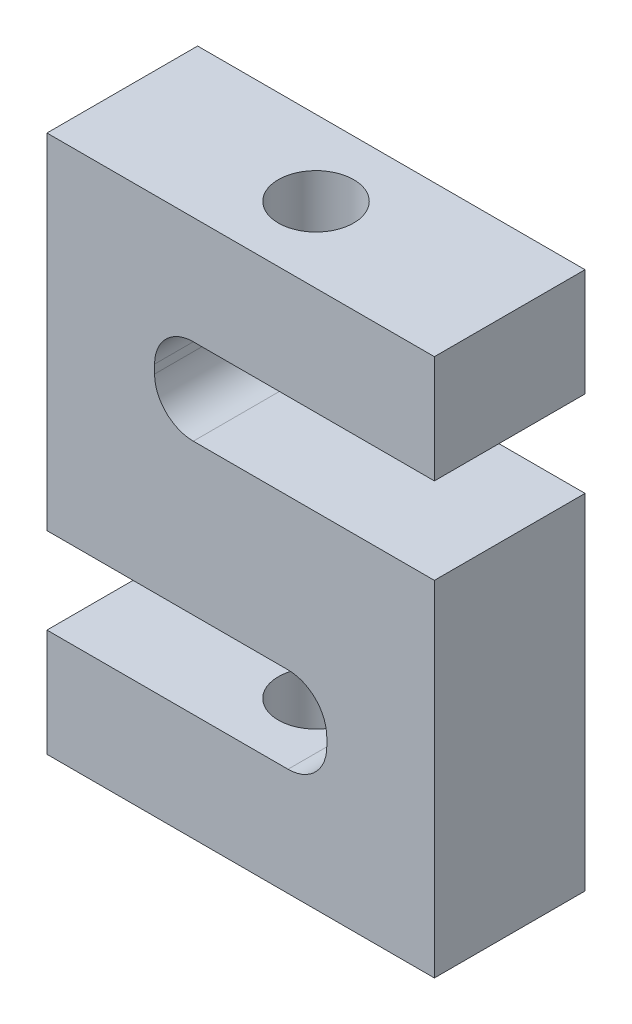
ISO-10303-21;
HEADER;
FILE_DESCRIPTION(('STEP AP214'),'2;1');
FILE_NAME('part.step','',(''),(''),'','','');
FILE_SCHEMA(('AUTOMOTIVE_DESIGN { 1 0 10303 214 1 1 1 1 }'));
ENDSEC;
DATA;
#1=APPLICATION_CONTEXT('core data for automotive mechanical design processes');
#2=APPLICATION_PROTOCOL_DEFINITION('international standard','automotive_design',2000,#1);
#3=PRODUCT_CONTEXT('',#1,'mechanical');
#4=PRODUCT('Part','Part','',(#3));
#5=PRODUCT_RELATED_PRODUCT_CATEGORY('part','',(#4));
#6=PRODUCT_DEFINITION_FORMATION('','',#4);
#7=PRODUCT_DEFINITION_CONTEXT('part definition',#1,'design');
#8=PRODUCT_DEFINITION('design','',#6,#7);
#9=PRODUCT_DEFINITION_SHAPE('','',#8);
#10=(LENGTH_UNIT() NAMED_UNIT(*) SI_UNIT(.MILLI.,.METRE.));
#11=(NAMED_UNIT(*) PLANE_ANGLE_UNIT() SI_UNIT($,.RADIAN.));
#12=(NAMED_UNIT(*) SI_UNIT($,.STERADIAN.) SOLID_ANGLE_UNIT());
#13=UNCERTAINTY_MEASURE_WITH_UNIT(LENGTH_MEASURE(1.E-05),#10,'distance_accuracy_value','');
#14=(GEOMETRIC_REPRESENTATION_CONTEXT(3) GLOBAL_UNCERTAINTY_ASSIGNED_CONTEXT((#13)) GLOBAL_UNIT_ASSIGNED_CONTEXT((#10,
#11,#12)) REPRESENTATION_CONTEXT('',''));
#15=CARTESIAN_POINT('',(0.,0.,0.));
#16=DIRECTION('',(0.,0.,1.));
#17=DIRECTION('',(1.,0.,0.));
#18=AXIS2_PLACEMENT_3D('',#15,#16,#17);
#19=CARTESIAN_POINT('',(-31.75,57.15,44.45));
#20=DIRECTION('',(0.,-1.,0.));
#21=DIRECTION('',(0.,0.,-1.));
#22=AXIS2_PLACEMENT_3D('',#19,#20,#21);
#23=PLANE('',#22);
#24=DIRECTION('',(-1.,0.,0.));
#25=VECTOR('',#24,1.);
#26=CARTESIAN_POINT('',(-31.75,57.15,0.));
#27=LINE('',#26,#25);
#28=CARTESIAN_POINT('',(82.55,57.15,0.));
#29=VERTEX_POINT('',#28);
#30=CARTESIAN_POINT('',(-31.75,57.15,0.));
#31=VERTEX_POINT('',#30);
#32=EDGE_CURVE('E321',#29,#31,#27,.T.);
#33=ORIENTED_EDGE('',*,*,#32,.T.);
#34=DIRECTION('',(0.,0.,-1.));
#35=VECTOR('',#34,1.);
#36=CARTESIAN_POINT('',(-31.75,57.15,44.45));
#37=LINE('',#36,#35);
#38=CARTESIAN_POINT('',(-31.75,57.15,44.45));
#39=VERTEX_POINT('',#38);
#40=EDGE_CURVE('E356',#39,#31,#37,.T.);
#41=ORIENTED_EDGE('',*,*,#40,.F.);
#42=DIRECTION('',(-1.,0.,0.));
#43=VECTOR('',#42,1.);
#44=CARTESIAN_POINT('',(-31.75,57.15,44.45));
#45=LINE('',#44,#43);
#46=CARTESIAN_POINT('',(82.55,57.15,44.45));
#47=VERTEX_POINT('',#46);
#48=EDGE_CURVE('E275',#47,#39,#45,.T.);
#49=ORIENTED_EDGE('',*,*,#48,.F.);
#50=DIRECTION('',(0.,0.,-1.));
#51=VECTOR('',#50,1.);
#52=CARTESIAN_POINT('',(82.55,57.15,44.45));
#53=LINE('',#52,#51);
#54=EDGE_CURVE('E218',#47,#29,#53,.T.);
#55=ORIENTED_EDGE('',*,*,#54,.T.);
#56=EDGE_LOOP('',(#33,#41,#49,#55));
#57=FACE_BOUND('',#56,.T.);
#58=CARTESIAN_POINT('',(25.3999999999999,57.15,22.225));
#59=DIRECTION('',(0.,1.,0.));
#60=DIRECTION('',(0.,0.,1.));
#61=AXIS2_PLACEMENT_3D('',#58,#59,#60);
#62=CIRCLE('',#61,11.1125);
#63=CARTESIAN_POINT('',(25.3999999999999,57.15,33.3375));
#64=VERTEX_POINT('',#63);
#65=EDGE_CURVE('E266',#64,#64,#62,.T.);
#66=ORIENTED_EDGE('',*,*,#65,.F.);
#67=EDGE_LOOP('',(#66));
#68=FACE_BOUND('',#67,.T.);
#69=ADVANCED_FACE('F43',(#57,#68),#23,.F.);
#70=CARTESIAN_POINT('',(82.55,-101.6,44.45));
#71=DIRECTION('',(0.,1.,0.));
#72=DIRECTION('',(0.,0.,1.));
#73=AXIS2_PLACEMENT_3D('',#70,#71,#72);
#74=PLANE('',#73);
#75=DIRECTION('',(1.,0.,0.));
#76=VECTOR('',#75,1.);
#77=CARTESIAN_POINT('',(82.55,-101.6,0.));
#78=LINE('',#77,#76);
#79=CARTESIAN_POINT('',(-31.75,-101.6,0.));
#80=VERTEX_POINT('',#79);
#81=CARTESIAN_POINT('',(82.55,-101.6,0.));
#82=VERTEX_POINT('',#81);
#83=EDGE_CURVE('E202',#80,#82,#78,.T.);
#84=ORIENTED_EDGE('',*,*,#83,.T.);
#85=DIRECTION('',(0.,0.,-1.));
#86=VECTOR('',#85,1.);
#87=CARTESIAN_POINT('',(82.55,-101.6,44.45));
#88=LINE('',#87,#86);
#89=CARTESIAN_POINT('',(82.55,-101.6,44.45));
#90=VERTEX_POINT('',#89);
#91=EDGE_CURVE('E307',#90,#82,#88,.T.);
#92=ORIENTED_EDGE('',*,*,#91,.F.);
#93=DIRECTION('',(1.,0.,0.));
#94=VECTOR('',#93,1.);
#95=CARTESIAN_POINT('',(82.55,-101.6,44.45));
#96=LINE('',#95,#94);
#97=CARTESIAN_POINT('',(-31.75,-101.6,44.45));
#98=VERTEX_POINT('',#97);
#99=EDGE_CURVE('E197',#98,#90,#96,.T.);
#100=ORIENTED_EDGE('',*,*,#99,.F.);
#101=DIRECTION('',(0.,0.,-1.));
#102=VECTOR('',#101,1.);
#103=CARTESIAN_POINT('',(-31.75,-101.6,44.45));
#104=LINE('',#103,#102);
#105=EDGE_CURVE('E344',#98,#80,#104,.T.);
#106=ORIENTED_EDGE('',*,*,#105,.T.);
#107=EDGE_LOOP('',(#84,#92,#100,#106));
#108=FACE_BOUND('',#107,.T.);
#109=CARTESIAN_POINT('',(25.4,-101.6,22.225));
#110=DIRECTION('',(0.,-1.,0.));
#111=DIRECTION('',(0.,0.,-1.));
#112=AXIS2_PLACEMENT_3D('',#109,#110,#111);
#113=CIRCLE('',#112,11.1125);
#114=CARTESIAN_POINT('',(25.4,-101.6,11.1125));
#115=VERTEX_POINT('',#114);
#116=EDGE_CURVE('E272',#115,#115,#113,.T.);
#117=ORIENTED_EDGE('',*,*,#116,.F.);
#118=EDGE_LOOP('',(#117));
#119=FACE_BOUND('',#118,.T.);
#120=ADVANCED_FACE('F407',(#108,#119),#74,.F.);
#121=CARTESIAN_POINT('',(82.55,0.,44.45));
#122=DIRECTION('',(-1.,0.,0.));
#123=DIRECTION('',(0.,0.,1.));
#124=AXIS2_PLACEMENT_3D('',#121,#122,#123);
#125=PLANE('',#124);
#126=DIRECTION('',(0.,1.,0.));
#127=VECTOR('',#126,1.);
#128=CARTESIAN_POINT('',(82.55,0.,0.));
#129=LINE('',#128,#127);
#130=CARTESIAN_POINT('',(82.55,0.,0.));
#131=VERTEX_POINT('',#130);
#132=EDGE_CURVE('E206',#82,#131,#129,.T.);
#133=ORIENTED_EDGE('',*,*,#132,.T.);
#134=DIRECTION('',(0.,0.,-1.));
#135=VECTOR('',#134,1.);
#136=CARTESIAN_POINT('',(82.55,0.,44.45));
#137=LINE('',#136,#135);
#138=CARTESIAN_POINT('',(82.55,0.,44.45));
#139=VERTEX_POINT('',#138);
#140=EDGE_CURVE('E186',#139,#131,#137,.T.);
#141=ORIENTED_EDGE('',*,*,#140,.F.);
#142=DIRECTION('',(0.,1.,0.));
#143=VECTOR('',#142,1.);
#144=CARTESIAN_POINT('',(82.55,0.,44.45));
#145=LINE('',#144,#143);
#146=EDGE_CURVE('E192',#90,#139,#145,.T.);
#147=ORIENTED_EDGE('',*,*,#146,.F.);
#148=ORIENTED_EDGE('',*,*,#91,.T.);
#149=EDGE_LOOP('',(#133,#141,#147,#148));
#150=FACE_BOUND('',#149,.T.);
#151=ADVANCED_FACE('F204',(#150),#125,.F.);
#152=CARTESIAN_POINT('',(82.55,0.,44.45));
#153=DIRECTION('',(0.,-1.,0.));
#154=DIRECTION('',(1.,0.,0.));
#155=AXIS2_PLACEMENT_3D('',#152,#153,#154);
#156=PLANE('',#155);
#157=DIRECTION('',(-1.,0.,0.));
#158=VECTOR('',#157,1.);
#159=CARTESIAN_POINT('',(82.55,0.,0.));
#160=LINE('',#159,#158);
#161=CARTESIAN_POINT('',(11.43,0.,0.));
#162=VERTEX_POINT('',#161);
#163=EDGE_CURVE('E264',#131,#162,#160,.T.);
#164=ORIENTED_EDGE('',*,*,#163,.T.);
#165=DIRECTION('',(0.,0.,-1.));
#166=VECTOR('',#165,1.);
#167=CARTESIAN_POINT('',(11.43,0.,44.45));
#168=LINE('',#167,#166);
#169=CARTESIAN_POINT('',(11.43,0.,44.45));
#170=VERTEX_POINT('',#169);
#171=EDGE_CURVE('E62',#162,#170,#168,.F.);
#172=ORIENTED_EDGE('',*,*,#171,.T.);
#173=DIRECTION('',(-1.,0.,0.));
#174=VECTOR('',#173,1.);
#175=CARTESIAN_POINT('',(82.55,0.,44.45));
#176=LINE('',#175,#174);
#177=EDGE_CURVE('E182',#139,#170,#176,.T.);
#178=ORIENTED_EDGE('',*,*,#177,.F.);
#179=ORIENTED_EDGE('',*,*,#140,.T.);
#180=EDGE_LOOP('',(#164,#172,#178,#179));
#181=FACE_BOUND('',#180,.T.);
#182=ADVANCED_FACE('F184',(#181),#156,.F.);
#183=CARTESIAN_POINT('',(0.,25.4,44.45));
#184=DIRECTION('',(-1.,0.,0.));
#185=DIRECTION('',(0.,0.,1.));
#186=AXIS2_PLACEMENT_3D('',#183,#184,#185);
#187=PLANE('',#186);
#188=DIRECTION('',(0.,1.,0.));
#189=VECTOR('',#188,1.);
#190=CARTESIAN_POINT('',(0.,25.4,0.));
#191=LINE('',#190,#189);
#192=CARTESIAN_POINT('',(0.,11.43,0.));
#193=VERTEX_POINT('',#192);
#194=CARTESIAN_POINT('',(0.,13.97,0.));
#195=VERTEX_POINT('',#194);
#196=EDGE_CURVE('E312',#193,#195,#191,.T.);
#197=ORIENTED_EDGE('',*,*,#196,.T.);
#198=DIRECTION('',(0.,0.,-1.));
#199=VECTOR('',#198,1.);
#200=CARTESIAN_POINT('',(0.,13.97,44.45));
#201=LINE('',#200,#199);
#202=CARTESIAN_POINT('',(0.,13.97,44.45));
#203=VERTEX_POINT('',#202);
#204=EDGE_CURVE('E239',#195,#203,#201,.F.);
#205=ORIENTED_EDGE('',*,*,#204,.T.);
#206=DIRECTION('',(0.,1.,0.));
#207=VECTOR('',#206,1.);
#208=CARTESIAN_POINT('',(0.,25.4,44.45));
#209=LINE('',#208,#207);
#210=CARTESIAN_POINT('',(0.,11.43,44.45));
#211=VERTEX_POINT('',#210);
#212=EDGE_CURVE('E191',#211,#203,#209,.T.);
#213=ORIENTED_EDGE('',*,*,#212,.F.);
#214=DIRECTION('',(0.,0.,-1.));
#215=VECTOR('',#214,1.);
#216=CARTESIAN_POINT('',(0.,11.43,0.));
#217=LINE('',#216,#215);
#218=EDGE_CURVE('E235',#211,#193,#217,.T.);
#219=ORIENTED_EDGE('',*,*,#218,.T.);
#220=EDGE_LOOP('',(#197,#205,#213,#219));
#221=FACE_BOUND('',#220,.T.);
#222=ADVANCED_FACE('F412',(#221),#187,.F.);
#223=CARTESIAN_POINT('',(82.55,25.4,44.45));
#224=DIRECTION('',(0.,1.,0.));
#225=DIRECTION('',(0.,0.,1.));
#226=AXIS2_PLACEMENT_3D('',#223,#224,#225);
#227=PLANE('',#226);
#228=CARTESIAN_POINT('',(25.3999999999999,25.4,22.225));
#229=DIRECTION('',(0.,1.,0.));
#230=DIRECTION('',(0.,0.,1.));
#231=AXIS2_PLACEMENT_3D('',#228,#229,#230);
#232=CIRCLE('',#231,11.1125);
#233=CARTESIAN_POINT('',(25.3999999999999,25.4,33.3375));
#234=VERTEX_POINT('',#233);
#235=EDGE_CURVE('E269',#234,#234,#232,.T.);
#236=ORIENTED_EDGE('',*,*,#235,.T.);
#237=EDGE_LOOP('',(#236));
#238=FACE_BOUND('',#237,.T.);
#239=DIRECTION('',(1.,0.,0.));
#240=VECTOR('',#239,1.);
#241=CARTESIAN_POINT('',(82.55,25.4,44.45));
#242=LINE('',#241,#240);
#243=CARTESIAN_POINT('',(11.43,25.4,44.45));
#244=VERTEX_POINT('',#243);
#245=CARTESIAN_POINT('',(82.55,25.4,44.45));
#246=VERTEX_POINT('',#245);
#247=EDGE_CURVE('E280',#244,#246,#242,.T.);
#248=ORIENTED_EDGE('',*,*,#247,.F.);
#249=DIRECTION('',(0.,0.,-1.));
#250=VECTOR('',#249,1.);
#251=CARTESIAN_POINT('',(11.43,25.4,0.));
#252=LINE('',#251,#250);
#253=CARTESIAN_POINT('',(11.43,25.4,0.));
#254=VERTEX_POINT('',#253);
#255=EDGE_CURVE('E231',#244,#254,#252,.T.);
#256=ORIENTED_EDGE('',*,*,#255,.T.);
#257=DIRECTION('',(1.,0.,0.));
#258=VECTOR('',#257,1.);
#259=CARTESIAN_POINT('',(82.55,25.4,0.));
#260=LINE('',#259,#258);
#261=CARTESIAN_POINT('',(82.55,25.4,0.));
#262=VERTEX_POINT('',#261);
#263=EDGE_CURVE('E315',#254,#262,#260,.T.);
#264=ORIENTED_EDGE('',*,*,#263,.T.);
#265=DIRECTION('',(0.,0.,-1.));
#266=VECTOR('',#265,1.);
#267=CARTESIAN_POINT('',(82.55,25.4,44.45));
#268=LINE('',#267,#266);
#269=EDGE_CURVE('E209',#246,#262,#268,.T.);
#270=ORIENTED_EDGE('',*,*,#269,.F.);
#271=EDGE_LOOP('',(#248,#256,#264,#270));
#272=FACE_BOUND('',#271,.T.);
#273=ADVANCED_FACE('F420',(#238,#272),#227,.F.);
#274=CARTESIAN_POINT('',(82.55,57.15,44.45));
#275=DIRECTION('',(-1.,0.,0.));
#276=DIRECTION('',(0.,0.,1.));
#277=AXIS2_PLACEMENT_3D('',#274,#275,#276);
#278=PLANE('',#277);
#279=DIRECTION('',(0.,1.,0.));
#280=VECTOR('',#279,1.);
#281=CARTESIAN_POINT('',(82.55,57.15,0.));
#282=LINE('',#281,#280);
#283=EDGE_CURVE('E318',#262,#29,#282,.T.);
#284=ORIENTED_EDGE('',*,*,#283,.T.);
#285=ORIENTED_EDGE('',*,*,#54,.F.);
#286=DIRECTION('',(0.,1.,0.));
#287=VECTOR('',#286,1.);
#288=CARTESIAN_POINT('',(82.55,57.15,44.45));
#289=LINE('',#288,#287);
#290=EDGE_CURVE('E278',#246,#47,#289,.T.);
#291=ORIENTED_EDGE('',*,*,#290,.F.);
#292=ORIENTED_EDGE('',*,*,#269,.T.);
#293=EDGE_LOOP('',(#284,#285,#291,#292));
#294=FACE_BOUND('',#293,.T.);
#295=ADVANCED_FACE('F421',(#294),#278,.F.);
#296=CARTESIAN_POINT('',(-31.75,-44.45,44.45));
#297=DIRECTION('',(1.,0.,0.));
#298=DIRECTION('',(0.,0.,-1.));
#299=AXIS2_PLACEMENT_3D('',#296,#297,#298);
#300=PLANE('',#299);
#301=DIRECTION('',(0.,-1.,0.));
#302=VECTOR('',#301,1.);
#303=CARTESIAN_POINT('',(-31.75,-44.45,0.));
#304=LINE('',#303,#302);
#305=CARTESIAN_POINT('',(-31.75,-44.45,0.));
#306=VERTEX_POINT('',#305);
#307=EDGE_CURVE('E324',#31,#306,#304,.T.);
#308=ORIENTED_EDGE('',*,*,#307,.T.);
#309=DIRECTION('',(0.,0.,-1.));
#310=VECTOR('',#309,1.);
#311=CARTESIAN_POINT('',(-31.75,-44.45,44.45));
#312=LINE('',#311,#310);
#313=CARTESIAN_POINT('',(-31.75,-44.45,44.45));
#314=VERTEX_POINT('',#313);
#315=EDGE_CURVE('E352',#314,#306,#312,.T.);
#316=ORIENTED_EDGE('',*,*,#315,.F.);
#317=DIRECTION('',(0.,-1.,0.));
#318=VECTOR('',#317,1.);
#319=CARTESIAN_POINT('',(-31.75,-44.45,44.45));
#320=LINE('',#319,#318);
#321=EDGE_CURVE('E277',#39,#314,#320,.T.);
#322=ORIENTED_EDGE('',*,*,#321,.F.);
#323=ORIENTED_EDGE('',*,*,#40,.T.);
#324=EDGE_LOOP('',(#308,#316,#322,#323));
#325=FACE_BOUND('',#324,.T.);
#326=ADVANCED_FACE('F376',(#325),#300,.F.);
#327=CARTESIAN_POINT('',(50.8,-44.45,44.45));
#328=DIRECTION('',(0.,1.,0.));
#329=DIRECTION('',(0.,0.,1.));
#330=AXIS2_PLACEMENT_3D('',#327,#328,#329);
#331=PLANE('',#330);
#332=DIRECTION('',(1.,0.,0.));
#333=VECTOR('',#332,1.);
#334=CARTESIAN_POINT('',(50.8,-44.45,0.));
#335=LINE('',#334,#333);
#336=CARTESIAN_POINT('',(39.37,-44.45,0.));
#337=VERTEX_POINT('',#336);
#338=EDGE_CURVE('E327',#306,#337,#335,.T.);
#339=ORIENTED_EDGE('',*,*,#338,.T.);
#340=DIRECTION('',(0.,0.,-1.));
#341=VECTOR('',#340,1.);
#342=CARTESIAN_POINT('',(39.37,-44.45,44.45));
#343=LINE('',#342,#341);
#344=CARTESIAN_POINT('',(39.37,-44.45,44.45));
#345=VERTEX_POINT('',#344);
#346=EDGE_CURVE('E228',#337,#345,#343,.F.);
#347=ORIENTED_EDGE('',*,*,#346,.T.);
#348=DIRECTION('',(1.,0.,0.));
#349=VECTOR('',#348,1.);
#350=CARTESIAN_POINT('',(50.8,-44.45,44.45));
#351=LINE('',#350,#349);
#352=EDGE_CURVE('E291',#314,#345,#351,.T.);
#353=ORIENTED_EDGE('',*,*,#352,.F.);
#354=ORIENTED_EDGE('',*,*,#315,.T.);
#355=EDGE_LOOP('',(#339,#347,#353,#354));
#356=FACE_BOUND('',#355,.T.);
#357=ADVANCED_FACE('F380',(#356),#331,.F.);
#358=CARTESIAN_POINT('',(50.8,-69.85,44.45));
#359=DIRECTION('',(1.,0.,0.));
#360=DIRECTION('',(0.,1.,0.));
#361=AXIS2_PLACEMENT_3D('',#358,#359,#360);
#362=PLANE('',#361);
#363=DIRECTION('',(0.,-1.,0.));
#364=VECTOR('',#363,1.);
#365=CARTESIAN_POINT('',(50.8,-69.85,0.));
#366=LINE('',#365,#364);
#367=CARTESIAN_POINT('',(50.8,-55.88,0.));
#368=VERTEX_POINT('',#367);
#369=CARTESIAN_POINT('',(50.8,-58.42,0.));
#370=VERTEX_POINT('',#369);
#371=EDGE_CURVE('E331',#368,#370,#366,.T.);
#372=ORIENTED_EDGE('',*,*,#371,.T.);
#373=DIRECTION('',(0.,0.,-1.));
#374=VECTOR('',#373,1.);
#375=CARTESIAN_POINT('',(50.8,-58.42,44.45));
#376=LINE('',#375,#374);
#377=CARTESIAN_POINT('',(50.8,-58.42,44.45));
#378=VERTEX_POINT('',#377);
#379=EDGE_CURVE('E225',#370,#378,#376,.F.);
#380=ORIENTED_EDGE('',*,*,#379,.T.);
#381=DIRECTION('',(0.,-1.,0.));
#382=VECTOR('',#381,1.);
#383=CARTESIAN_POINT('',(50.8,-69.85,44.45));
#384=LINE('',#383,#382);
#385=CARTESIAN_POINT('',(50.8,-55.88,44.45));
#386=VERTEX_POINT('',#385);
#387=EDGE_CURVE('E295',#386,#378,#384,.T.);
#388=ORIENTED_EDGE('',*,*,#387,.F.);
#389=DIRECTION('',(0.,0.,-1.));
#390=VECTOR('',#389,1.);
#391=CARTESIAN_POINT('',(50.8,-55.88,0.));
#392=LINE('',#391,#390);
#393=EDGE_CURVE('E214',#386,#368,#392,.T.);
#394=ORIENTED_EDGE('',*,*,#393,.T.);
#395=EDGE_LOOP('',(#372,#380,#388,#394));
#396=FACE_BOUND('',#395,.T.);
#397=ADVANCED_FACE('F389',(#396),#362,.F.);
#398=CARTESIAN_POINT('',(-31.75,-69.85,44.45));
#399=DIRECTION('',(0.,-1.,0.));
#400=DIRECTION('',(0.,0.,-1.));
#401=AXIS2_PLACEMENT_3D('',#398,#399,#400);
#402=PLANE('',#401);
#403=CARTESIAN_POINT('',(25.4,-69.85,22.225));
#404=DIRECTION('',(0.,-1.,0.));
#405=DIRECTION('',(0.,0.,-1.));
#406=AXIS2_PLACEMENT_3D('',#403,#404,#405);
#407=CIRCLE('',#406,11.1125);
#408=CARTESIAN_POINT('',(25.4,-69.85,11.1125));
#409=VERTEX_POINT('',#408);
#410=EDGE_CURVE('E310',#409,#409,#407,.T.);
#411=ORIENTED_EDGE('',*,*,#410,.T.);
#412=EDGE_LOOP('',(#411));
#413=FACE_BOUND('',#412,.T.);
#414=DIRECTION('',(-1.,0.,0.));
#415=VECTOR('',#414,1.);
#416=CARTESIAN_POINT('',(-31.75,-69.85,44.45));
#417=LINE('',#416,#415);
#418=CARTESIAN_POINT('',(39.37,-69.85,44.45));
#419=VERTEX_POINT('',#418);
#420=CARTESIAN_POINT('',(-31.75,-69.85,44.45));
#421=VERTEX_POINT('',#420);
#422=EDGE_CURVE('E299',#419,#421,#417,.T.);
#423=ORIENTED_EDGE('',*,*,#422,.F.);
#424=DIRECTION('',(0.,0.,-1.));
#425=VECTOR('',#424,1.);
#426=CARTESIAN_POINT('',(39.37,-69.85,0.));
#427=LINE('',#426,#425);
#428=CARTESIAN_POINT('',(39.37,-69.85,0.));
#429=VERTEX_POINT('',#428);
#430=EDGE_CURVE('E208',#419,#429,#427,.T.);
#431=ORIENTED_EDGE('',*,*,#430,.T.);
#432=DIRECTION('',(-1.,0.,0.));
#433=VECTOR('',#432,1.);
#434=CARTESIAN_POINT('',(-31.75,-69.85,0.));
#435=LINE('',#434,#433);
#436=CARTESIAN_POINT('',(-31.75,-69.85,0.));
#437=VERTEX_POINT('',#436);
#438=EDGE_CURVE('E335',#429,#437,#435,.T.);
#439=ORIENTED_EDGE('',*,*,#438,.T.);
#440=DIRECTION('',(0.,0.,-1.));
#441=VECTOR('',#440,1.);
#442=CARTESIAN_POINT('',(-31.75,-69.85,44.45));
#443=LINE('',#442,#441);
#444=EDGE_CURVE('E348',#421,#437,#443,.T.);
#445=ORIENTED_EDGE('',*,*,#444,.F.);
#446=EDGE_LOOP('',(#423,#431,#439,#445));
#447=FACE_BOUND('',#446,.T.);
#448=ADVANCED_FACE('F399',(#413,#447),#402,.F.);
#449=CARTESIAN_POINT('',(-31.75,-101.6,44.45));
#450=DIRECTION('',(1.,0.,0.));
#451=DIRECTION('',(0.,0.,-1.));
#452=AXIS2_PLACEMENT_3D('',#449,#450,#451);
#453=PLANE('',#452);
#454=DIRECTION('',(0.,-1.,0.));
#455=VECTOR('',#454,1.);
#456=CARTESIAN_POINT('',(-31.75,-101.6,0.));
#457=LINE('',#456,#455);
#458=EDGE_CURVE('E338',#437,#80,#457,.T.);
#459=ORIENTED_EDGE('',*,*,#458,.T.);
#460=ORIENTED_EDGE('',*,*,#105,.F.);
#461=DIRECTION('',(0.,-1.,0.));
#462=VECTOR('',#461,1.);
#463=CARTESIAN_POINT('',(-31.75,-101.6,44.45));
#464=LINE('',#463,#462);
#465=EDGE_CURVE('E302',#421,#98,#464,.T.);
#466=ORIENTED_EDGE('',*,*,#465,.F.);
#467=ORIENTED_EDGE('',*,*,#444,.T.);
#468=EDGE_LOOP('',(#459,#460,#466,#467));
#469=FACE_BOUND('',#468,.T.);
#470=ADVANCED_FACE('F404',(#469),#453,.F.);
#471=CARTESIAN_POINT('',(82.55,-101.6,44.45));
#472=DIRECTION('',(0.,0.,-1.));
#473=DIRECTION('',(-1.,0.,0.));
#474=AXIS2_PLACEMENT_3D('',#471,#472,#473);
#475=PLANE('',#474);
#476=ORIENTED_EDGE('',*,*,#146,.T.);
#477=ORIENTED_EDGE('',*,*,#177,.T.);
#478=CARTESIAN_POINT('',(11.43,11.43,44.45));
#479=DIRECTION('',(0.,0.,-1.));
#480=DIRECTION('',(-1.,0.,0.));
#481=AXIS2_PLACEMENT_3D('',#478,#479,#480);
#482=CIRCLE('',#481,11.43);
#483=EDGE_CURVE('E11',#170,#211,#482,.T.);
#484=ORIENTED_EDGE('',*,*,#483,.T.);
#485=ORIENTED_EDGE('',*,*,#212,.T.);
#486=CARTESIAN_POINT('',(11.43,13.97,44.45));
#487=DIRECTION('',(0.,0.,-1.));
#488=DIRECTION('',(-1.,0.,0.));
#489=AXIS2_PLACEMENT_3D('',#486,#487,#488);
#490=CIRCLE('',#489,11.43);
#491=EDGE_CURVE('E259',#203,#244,#490,.T.);
#492=ORIENTED_EDGE('',*,*,#491,.T.);
#493=ORIENTED_EDGE('',*,*,#247,.T.);
#494=ORIENTED_EDGE('',*,*,#290,.T.);
#495=ORIENTED_EDGE('',*,*,#48,.T.);
#496=ORIENTED_EDGE('',*,*,#321,.T.);
#497=ORIENTED_EDGE('',*,*,#352,.T.);
#498=CARTESIAN_POINT('',(39.37,-55.88,44.45));
#499=DIRECTION('',(0.,0.,-1.));
#500=DIRECTION('',(-1.,0.,0.));
#501=AXIS2_PLACEMENT_3D('',#498,#499,#500);
#502=CIRCLE('',#501,11.43);
#503=EDGE_CURVE('E253',#345,#386,#502,.T.);
#504=ORIENTED_EDGE('',*,*,#503,.T.);
#505=ORIENTED_EDGE('',*,*,#387,.T.);
#506=CARTESIAN_POINT('',(39.37,-58.42,44.45));
#507=DIRECTION('',(0.,0.,-1.));
#508=DIRECTION('',(-1.,0.,0.));
#509=AXIS2_PLACEMENT_3D('',#506,#507,#508);
#510=CIRCLE('',#509,11.43);
#511=EDGE_CURVE('E247',#378,#419,#510,.T.);
#512=ORIENTED_EDGE('',*,*,#511,.T.);
#513=ORIENTED_EDGE('',*,*,#422,.T.);
#514=ORIENTED_EDGE('',*,*,#465,.T.);
#515=ORIENTED_EDGE('',*,*,#99,.T.);
#516=EDGE_LOOP('',(#476,#477,#484,#485,#492,#493,#494,#495,#496,#497,#504,#505,#512,#513,#514,#515));
#517=FACE_BOUND('',#516,.T.);
#518=ADVANCED_FACE('F195',(#517),#475,.F.);
#519=CARTESIAN_POINT('',(82.55,-101.6,0.));
#520=DIRECTION('',(0.,0.,-1.));
#521=DIRECTION('',(-1.,0.,0.));
#522=AXIS2_PLACEMENT_3D('',#519,#520,#521);
#523=PLANE('',#522);
#524=ORIENTED_EDGE('',*,*,#132,.F.);
#525=ORIENTED_EDGE('',*,*,#83,.F.);
#526=ORIENTED_EDGE('',*,*,#458,.F.);
#527=ORIENTED_EDGE('',*,*,#438,.F.);
#528=CARTESIAN_POINT('',(39.37,-58.42,0.));
#529=DIRECTION('',(0.,0.,-1.));
#530=DIRECTION('',(-1.,0.,0.));
#531=AXIS2_PLACEMENT_3D('',#528,#529,#530);
#532=CIRCLE('',#531,11.43);
#533=EDGE_CURVE('E244',#429,#370,#532,.F.);
#534=ORIENTED_EDGE('',*,*,#533,.T.);
#535=ORIENTED_EDGE('',*,*,#371,.F.);
#536=CARTESIAN_POINT('',(39.37,-55.88,0.));
#537=DIRECTION('',(0.,0.,-1.));
#538=DIRECTION('',(-1.,0.,0.));
#539=AXIS2_PLACEMENT_3D('',#536,#537,#538);
#540=CIRCLE('',#539,11.43);
#541=EDGE_CURVE('E250',#368,#337,#540,.F.);
#542=ORIENTED_EDGE('',*,*,#541,.T.);
#543=ORIENTED_EDGE('',*,*,#338,.F.);
#544=ORIENTED_EDGE('',*,*,#307,.F.);
#545=ORIENTED_EDGE('',*,*,#32,.F.);
#546=ORIENTED_EDGE('',*,*,#283,.F.);
#547=ORIENTED_EDGE('',*,*,#263,.F.);
#548=CARTESIAN_POINT('',(11.43,13.97,0.));
#549=DIRECTION('',(0.,0.,-1.));
#550=DIRECTION('',(-1.,0.,0.));
#551=AXIS2_PLACEMENT_3D('',#548,#549,#550);
#552=CIRCLE('',#551,11.43);
#553=EDGE_CURVE('E256',#254,#195,#552,.F.);
#554=ORIENTED_EDGE('',*,*,#553,.T.);
#555=ORIENTED_EDGE('',*,*,#196,.F.);
#556=CARTESIAN_POINT('',(11.43,11.43,0.));
#557=DIRECTION('',(0.,0.,-1.));
#558=DIRECTION('',(-1.,0.,0.));
#559=AXIS2_PLACEMENT_3D('',#556,#557,#558);
#560=CIRCLE('',#559,11.43);
#561=EDGE_CURVE('E52',#193,#162,#560,.F.);
#562=ORIENTED_EDGE('',*,*,#561,.T.);
#563=ORIENTED_EDGE('',*,*,#163,.F.);
#564=EDGE_LOOP('',(#524,#525,#526,#527,#534,#535,#542,#543,#544,#545,#546,#547,#554,#555,#562,#563));
#565=FACE_BOUND('',#564,.T.);
#566=ADVANCED_FACE('F371',(#565),#523,.T.);
#567=CARTESIAN_POINT('',(39.37,-58.42,44.45));
#568=DIRECTION('',(0.,0.,1.));
#569=DIRECTION('',(1.,0.,0.));
#570=AXIS2_PLACEMENT_3D('',#567,#568,#569);
#571=CYLINDRICAL_SURFACE('',#570,11.43);
#572=ORIENTED_EDGE('',*,*,#511,.F.);
#573=ORIENTED_EDGE('',*,*,#379,.F.);
#574=ORIENTED_EDGE('',*,*,#533,.F.);
#575=ORIENTED_EDGE('',*,*,#430,.F.);
#576=EDGE_LOOP('',(#572,#573,#574,#575));
#577=FACE_BOUND('',#576,.T.);
#578=ADVANCED_FACE('F396',(#577),#571,.F.);
#579=CARTESIAN_POINT('',(39.37,-55.88,44.45));
#580=DIRECTION('',(0.,0.,1.));
#581=DIRECTION('',(1.,0.,0.));
#582=AXIS2_PLACEMENT_3D('',#579,#580,#581);
#583=CYLINDRICAL_SURFACE('',#582,11.43);
#584=ORIENTED_EDGE('',*,*,#503,.F.);
#585=ORIENTED_EDGE('',*,*,#346,.F.);
#586=ORIENTED_EDGE('',*,*,#541,.F.);
#587=ORIENTED_EDGE('',*,*,#393,.F.);
#588=EDGE_LOOP('',(#584,#585,#586,#587));
#589=FACE_BOUND('',#588,.T.);
#590=ADVANCED_FACE('F386',(#589),#583,.F.);
#591=CARTESIAN_POINT('',(11.43,13.97,44.45));
#592=DIRECTION('',(0.,0.,1.));
#593=DIRECTION('',(1.,0.,0.));
#594=AXIS2_PLACEMENT_3D('',#591,#592,#593);
#595=CYLINDRICAL_SURFACE('',#594,11.43);
#596=ORIENTED_EDGE('',*,*,#491,.F.);
#597=ORIENTED_EDGE('',*,*,#204,.F.);
#598=ORIENTED_EDGE('',*,*,#553,.F.);
#599=ORIENTED_EDGE('',*,*,#255,.F.);
#600=EDGE_LOOP('',(#596,#597,#598,#599));
#601=FACE_BOUND('',#600,.T.);
#602=ADVANCED_FACE('F415',(#601),#595,.F.);
#603=CARTESIAN_POINT('',(11.43,11.43,44.45));
#604=DIRECTION('',(0.,0.,1.));
#605=DIRECTION('',(1.,0.,0.));
#606=AXIS2_PLACEMENT_3D('',#603,#604,#605);
#607=CYLINDRICAL_SURFACE('',#606,11.43);
#608=ORIENTED_EDGE('',*,*,#483,.F.);
#609=ORIENTED_EDGE('',*,*,#171,.F.);
#610=ORIENTED_EDGE('',*,*,#561,.F.);
#611=ORIENTED_EDGE('',*,*,#218,.F.);
#612=EDGE_LOOP('',(#608,#609,#610,#611));
#613=FACE_BOUND('',#612,.T.);
#614=ADVANCED_FACE('F45',(#613),#607,.F.);
#615=CARTESIAN_POINT('',(25.4,-101.6,22.225));
#616=DIRECTION('',(0.,-1.,0.));
#617=DIRECTION('',(0.,0.,-1.));
#618=AXIS2_PLACEMENT_3D('',#615,#616,#617);
#619=CYLINDRICAL_SURFACE('',#618,11.1125);
#620=ORIENTED_EDGE('',*,*,#410,.F.);
#621=EDGE_LOOP('',(#620));
#622=FACE_BOUND('',#621,.T.);
#623=ORIENTED_EDGE('',*,*,#116,.T.);
#624=EDGE_LOOP('',(#623));
#625=FACE_BOUND('',#624,.T.);
#626=ADVANCED_FACE('F451',(#622,#625),#619,.F.);
#627=CARTESIAN_POINT('',(25.3999999999999,57.15,22.225));
#628=DIRECTION('',(0.,1.,0.));
#629=DIRECTION('',(0.,0.,1.));
#630=AXIS2_PLACEMENT_3D('',#627,#628,#629);
#631=CYLINDRICAL_SURFACE('',#630,11.1125);
#632=ORIENTED_EDGE('',*,*,#235,.F.);
#633=EDGE_LOOP('',(#632));
#634=FACE_BOUND('',#633,.T.);
#635=ORIENTED_EDGE('',*,*,#65,.T.);
#636=EDGE_LOOP('',(#635));
#637=FACE_BOUND('',#636,.T.);
#638=ADVANCED_FACE('F454',(#634,#637),#631,.F.);
#639=CLOSED_SHELL('',(#69,#120,#151,#182,#222,#273,#295,#326,#357,#397,#448,#470,#518,#566,#578,
#590,#602,#614,#626,#638));
#640=MANIFOLD_SOLID_BREP('B2',#639);
#641=ADVANCED_BREP_SHAPE_REPRESENTATION('',(#18,#640),#14);
#642=SHAPE_DEFINITION_REPRESENTATION(#9,#641);
ENDSEC;
END-ISO-10303-21;
